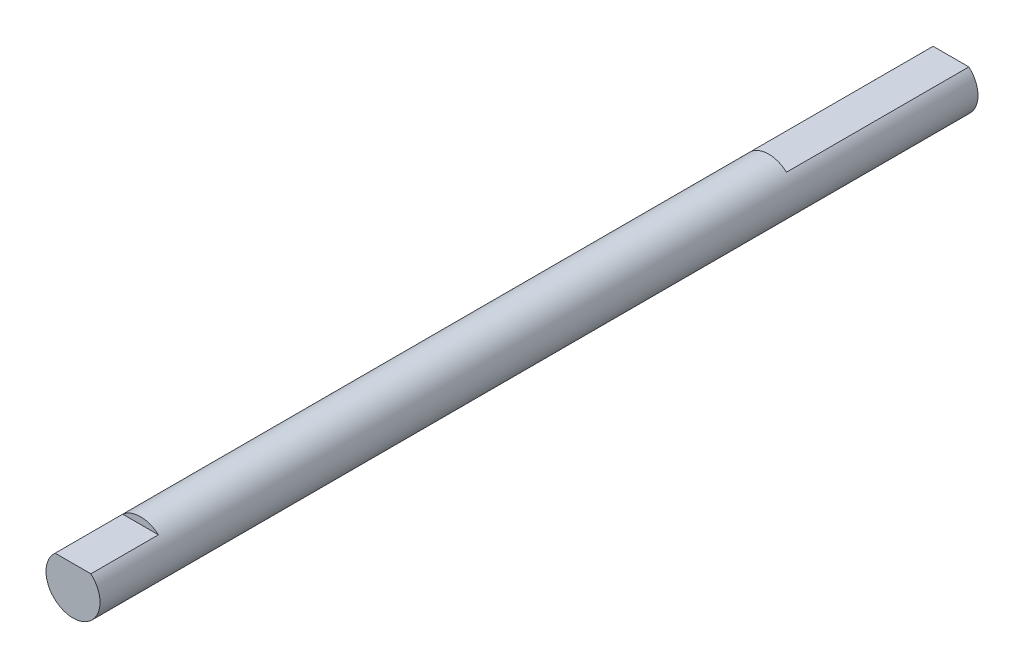
ISO-10303-21;
HEADER;
FILE_DESCRIPTION(('STEP AP214'),'2;1');
FILE_NAME('part.step','',(''),(''),'','','');
FILE_SCHEMA(('AUTOMOTIVE_DESIGN { 1 0 10303 214 1 1 1 1 }'));
ENDSEC;
DATA;
#1=APPLICATION_CONTEXT('core data for automotive mechanical design processes');
#2=APPLICATION_PROTOCOL_DEFINITION('international standard','automotive_design',2000,#1);
#3=PRODUCT_CONTEXT('',#1,'mechanical');
#4=PRODUCT('Part','Part','',(#3));
#5=PRODUCT_RELATED_PRODUCT_CATEGORY('part','',(#4));
#6=PRODUCT_DEFINITION_FORMATION('','',#4);
#7=PRODUCT_DEFINITION_CONTEXT('part definition',#1,'design');
#8=PRODUCT_DEFINITION('design','',#6,#7);
#9=PRODUCT_DEFINITION_SHAPE('','',#8);
#10=(LENGTH_UNIT() NAMED_UNIT(*) SI_UNIT(.MILLI.,.METRE.));
#11=(NAMED_UNIT(*) PLANE_ANGLE_UNIT() SI_UNIT($,.RADIAN.));
#12=(NAMED_UNIT(*) SI_UNIT($,.STERADIAN.) SOLID_ANGLE_UNIT());
#13=UNCERTAINTY_MEASURE_WITH_UNIT(LENGTH_MEASURE(1.E-05),#10,'distance_accuracy_value','');
#14=(GEOMETRIC_REPRESENTATION_CONTEXT(3) GLOBAL_UNCERTAINTY_ASSIGNED_CONTEXT((#13)) GLOBAL_UNIT_ASSIGNED_CONTEXT((#10,
#11,#12)) REPRESENTATION_CONTEXT('',''));
#15=CARTESIAN_POINT('',(0.,0.,0.));
#16=DIRECTION('',(0.,0.,1.));
#17=DIRECTION('',(1.,0.,0.));
#18=AXIS2_PLACEMENT_3D('',#15,#16,#17);
#19=CARTESIAN_POINT('',(0.,0.,-58.));
#20=DIRECTION('',(0.,0.,1.));
#21=DIRECTION('',(1.,0.,0.));
#22=AXIS2_PLACEMENT_3D('',#19,#20,#21);
#23=CYLINDRICAL_SURFACE('',#22,4.);
#24=DIRECTION('',(0.,0.,-1.));
#25=VECTOR('',#24,1.);
#26=CARTESIAN_POINT('',(2.64575131106459,3.,-31.));
#27=LINE('',#26,#25);
#28=CARTESIAN_POINT('',(2.64575131106459,3.,-31.));
#29=VERTEX_POINT('',#28);
#30=CARTESIAN_POINT('',(2.64575131106459,3.,-58.));
#31=VERTEX_POINT('',#30);
#32=EDGE_CURVE('E57',#29,#31,#27,.T.);
#33=ORIENTED_EDGE('',*,*,#32,.F.);
#34=CARTESIAN_POINT('',(0.,0.,-31.));
#35=DIRECTION('',(0.,0.,-1.));
#36=DIRECTION('',(-1.,0.,0.));
#37=AXIS2_PLACEMENT_3D('',#34,#35,#36);
#38=CIRCLE('',#37,4.);
#39=CARTESIAN_POINT('',(-2.64575131106459,3.,-31.));
#40=VERTEX_POINT('',#39);
#41=EDGE_CURVE('E85',#40,#29,#38,.T.);
#42=ORIENTED_EDGE('',*,*,#41,.F.);
#43=DIRECTION('',(0.,0.,-1.));
#44=VECTOR('',#43,1.);
#45=CARTESIAN_POINT('',(-2.64575131106459,3.,-31.));
#46=LINE('',#45,#44);
#47=CARTESIAN_POINT('',(-2.64575131106459,3.,-58.));
#48=VERTEX_POINT('',#47);
#49=EDGE_CURVE('E94',#40,#48,#46,.T.);
#50=ORIENTED_EDGE('',*,*,#49,.T.);
#51=CARTESIAN_POINT('',(0.,0.,-58.));
#52=DIRECTION('',(0.,0.,1.));
#53=DIRECTION('',(1.,0.,0.));
#54=AXIS2_PLACEMENT_3D('',#51,#52,#53);
#55=CIRCLE('',#54,4.);
#56=EDGE_CURVE('E11',#48,#31,#55,.T.);
#57=ORIENTED_EDGE('',*,*,#56,.T.);
#58=EDGE_LOOP('',(#33,#42,#50,#57));
#59=FACE_BOUND('',#58,.T.);
#60=DIRECTION('',(0.,0.,1.));
#61=VECTOR('',#60,1.);
#62=CARTESIAN_POINT('',(2.64575131106459,3.,62.));
#63=LINE('',#62,#61);
#64=CARTESIAN_POINT('',(2.64575131106459,3.,62.));
#65=VERTEX_POINT('',#64);
#66=CARTESIAN_POINT('',(2.64575131106459,3.,72.));
#67=VERTEX_POINT('',#66);
#68=EDGE_CURVE('E116',#65,#67,#63,.T.);
#69=ORIENTED_EDGE('',*,*,#68,.T.);
#70=CARTESIAN_POINT('',(0.,0.,72.));
#71=DIRECTION('',(0.,0.,1.));
#72=DIRECTION('',(1.,0.,0.));
#73=AXIS2_PLACEMENT_3D('',#70,#71,#72);
#74=CIRCLE('',#73,4.);
#75=CARTESIAN_POINT('',(-2.64575131106459,3.,72.));
#76=VERTEX_POINT('',#75);
#77=EDGE_CURVE('E50',#76,#67,#74,.T.);
#78=ORIENTED_EDGE('',*,*,#77,.F.);
#79=DIRECTION('',(0.,0.,1.));
#80=VECTOR('',#79,1.);
#81=CARTESIAN_POINT('',(-2.64575131106459,3.,62.));
#82=LINE('',#81,#80);
#83=CARTESIAN_POINT('',(-2.64575131106459,3.,62.));
#84=VERTEX_POINT('',#83);
#85=EDGE_CURVE('E65',#84,#76,#82,.T.);
#86=ORIENTED_EDGE('',*,*,#85,.F.);
#87=CARTESIAN_POINT('',(0.,0.,62.));
#88=DIRECTION('',(0.,0.,1.));
#89=DIRECTION('',(1.,0.,0.));
#90=AXIS2_PLACEMENT_3D('',#87,#88,#89);
#91=CIRCLE('',#90,4.);
#92=EDGE_CURVE('E107',#65,#84,#91,.T.);
#93=ORIENTED_EDGE('',*,*,#92,.F.);
#94=EDGE_LOOP('',(#69,#78,#86,#93));
#95=FACE_BOUND('',#94,.T.);
#96=ADVANCED_FACE('F42',(#59,#95),#23,.T.);
#97=CARTESIAN_POINT('',(0.,0.,-58.));
#98=DIRECTION('',(0.,0.,1.));
#99=DIRECTION('',(1.,0.,0.));
#100=AXIS2_PLACEMENT_3D('',#97,#98,#99);
#101=PLANE('',#100);
#102=ORIENTED_EDGE('',*,*,#56,.F.);
#103=DIRECTION('',(-1.,0.,0.));
#104=VECTOR('',#103,1.);
#105=CARTESIAN_POINT('',(-2.64575131106459,3.,-58.));
#106=LINE('',#105,#104);
#107=EDGE_CURVE('E91',#31,#48,#106,.T.);
#108=ORIENTED_EDGE('',*,*,#107,.F.);
#109=EDGE_LOOP('',(#102,#108));
#110=FACE_BOUND('',#109,.T.);
#111=ADVANCED_FACE('F140',(#110),#101,.F.);
#112=CARTESIAN_POINT('',(0.,0.,72.));
#113=DIRECTION('',(0.,0.,1.));
#114=DIRECTION('',(1.,0.,0.));
#115=AXIS2_PLACEMENT_3D('',#112,#113,#114);
#116=PLANE('',#115);
#117=DIRECTION('',(1.,0.,0.));
#118=VECTOR('',#117,1.);
#119=CARTESIAN_POINT('',(2.64575131106459,3.,72.));
#120=LINE('',#119,#118);
#121=EDGE_CURVE('E103',#76,#67,#120,.T.);
#122=ORIENTED_EDGE('',*,*,#121,.F.);
#123=ORIENTED_EDGE('',*,*,#77,.T.);
#124=EDGE_LOOP('',(#122,#123));
#125=FACE_BOUND('',#124,.T.);
#126=ADVANCED_FACE('F126',(#125),#116,.T.);
#127=CARTESIAN_POINT('',(2.64575131106459,3.,62.));
#128=DIRECTION('',(0.,-1.,0.));
#129=DIRECTION('',(1.,0.,0.));
#130=AXIS2_PLACEMENT_3D('',#127,#128,#129);
#131=PLANE('',#130);
#132=ORIENTED_EDGE('',*,*,#121,.T.);
#133=ORIENTED_EDGE('',*,*,#68,.F.);
#134=DIRECTION('',(1.,0.,0.));
#135=VECTOR('',#134,1.);
#136=CARTESIAN_POINT('',(2.64575131106459,3.,62.));
#137=LINE('',#136,#135);
#138=EDGE_CURVE('E110',#84,#65,#137,.T.);
#139=ORIENTED_EDGE('',*,*,#138,.F.);
#140=ORIENTED_EDGE('',*,*,#85,.T.);
#141=EDGE_LOOP('',(#132,#133,#139,#140));
#142=FACE_BOUND('',#141,.T.);
#143=ADVANCED_FACE('F128',(#142),#131,.F.);
#144=CARTESIAN_POINT('',(0.,0.,62.));
#145=DIRECTION('',(0.,0.,1.));
#146=DIRECTION('',(1.,0.,0.));
#147=AXIS2_PLACEMENT_3D('',#144,#145,#146);
#148=PLANE('',#147);
#149=ORIENTED_EDGE('',*,*,#92,.T.);
#150=ORIENTED_EDGE('',*,*,#138,.T.);
#151=EDGE_LOOP('',(#149,#150));
#152=FACE_BOUND('',#151,.T.);
#153=ADVANCED_FACE('F130',(#152),#148,.T.);
#154=CARTESIAN_POINT('',(-2.64575131106459,3.,-31.));
#155=DIRECTION('',(0.,-1.,0.));
#156=DIRECTION('',(0.,0.,-1.));
#157=AXIS2_PLACEMENT_3D('',#154,#155,#156);
#158=PLANE('',#157);
#159=ORIENTED_EDGE('',*,*,#107,.T.);
#160=ORIENTED_EDGE('',*,*,#49,.F.);
#161=DIRECTION('',(-1.,0.,0.));
#162=VECTOR('',#161,1.);
#163=CARTESIAN_POINT('',(-2.64575131106459,3.,-31.));
#164=LINE('',#163,#162);
#165=EDGE_CURVE('E87',#29,#40,#164,.T.);
#166=ORIENTED_EDGE('',*,*,#165,.F.);
#167=ORIENTED_EDGE('',*,*,#32,.T.);
#168=EDGE_LOOP('',(#159,#160,#166,#167));
#169=FACE_BOUND('',#168,.T.);
#170=ADVANCED_FACE('F93',(#169),#158,.F.);
#171=CARTESIAN_POINT('',(0.,0.,-31.));
#172=DIRECTION('',(0.,0.,-1.));
#173=DIRECTION('',(-1.,0.,0.));
#174=AXIS2_PLACEMENT_3D('',#171,#172,#173);
#175=PLANE('',#174);
#176=ORIENTED_EDGE('',*,*,#41,.T.);
#177=ORIENTED_EDGE('',*,*,#165,.T.);
#178=EDGE_LOOP('',(#176,#177));
#179=FACE_BOUND('',#178,.T.);
#180=ADVANCED_FACE('F86',(#179),#175,.T.);
#181=CLOSED_SHELL('',(#96,#111,#126,#143,#153,#170,#180));
#182=MANIFOLD_SOLID_BREP('B2',#181);
#183=ADVANCED_BREP_SHAPE_REPRESENTATION('',(#18,#182),#14);
#184=SHAPE_DEFINITION_REPRESENTATION(#9,#183);
ENDSEC;
END-ISO-10303-21;
